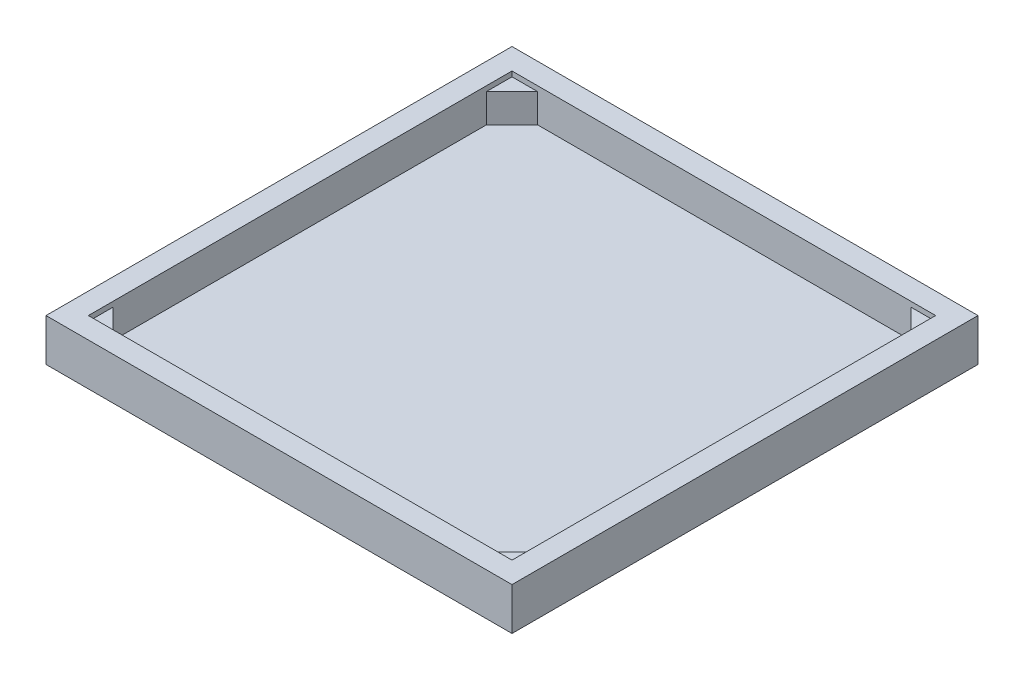
ISO-10303-21;
HEADER;
FILE_DESCRIPTION(('STEP AP214'),'2;1');
FILE_NAME('part.step','',(''),(''),'','','');
FILE_SCHEMA(('AUTOMOTIVE_DESIGN { 1 0 10303 214 1 1 1 1 }'));
ENDSEC;
DATA;
#1=APPLICATION_CONTEXT('core data for automotive mechanical design processes');
#2=APPLICATION_PROTOCOL_DEFINITION('international standard','automotive_design',2000,#1);
#3=PRODUCT_CONTEXT('',#1,'mechanical');
#4=PRODUCT('Part','Part','',(#3));
#5=PRODUCT_RELATED_PRODUCT_CATEGORY('part','',(#4));
#6=PRODUCT_DEFINITION_FORMATION('','',#4);
#7=PRODUCT_DEFINITION_CONTEXT('part definition',#1,'design');
#8=PRODUCT_DEFINITION('design','',#6,#7);
#9=PRODUCT_DEFINITION_SHAPE('','',#8);
#10=(LENGTH_UNIT() NAMED_UNIT(*) SI_UNIT(.MILLI.,.METRE.));
#11=(NAMED_UNIT(*) PLANE_ANGLE_UNIT() SI_UNIT($,.RADIAN.));
#12=(NAMED_UNIT(*) SI_UNIT($,.STERADIAN.) SOLID_ANGLE_UNIT());
#13=UNCERTAINTY_MEASURE_WITH_UNIT(LENGTH_MEASURE(1.E-05),#10,'distance_accuracy_value','');
#14=(GEOMETRIC_REPRESENTATION_CONTEXT(3) GLOBAL_UNCERTAINTY_ASSIGNED_CONTEXT((#13)) GLOBAL_UNIT_ASSIGNED_CONTEXT((#10,
#11,#12)) REPRESENTATION_CONTEXT('',''));
#15=CARTESIAN_POINT('',(0.,0.,0.));
#16=DIRECTION('',(0.,0.,1.));
#17=DIRECTION('',(1.,0.,0.));
#18=AXIS2_PLACEMENT_3D('',#15,#16,#17);
#19=CARTESIAN_POINT('',(0.,10.,0.));
#20=DIRECTION('',(0.,1.,0.));
#21=DIRECTION('',(0.,0.,1.));
#22=AXIS2_PLACEMENT_3D('',#19,#20,#21);
#23=PLANE('',#22);
#24=DIRECTION('',(0.,0.,-1.));
#25=VECTOR('',#24,1.);
#26=CARTESIAN_POINT('',(250.,10.,250.));
#27=LINE('',#26,#25);
#28=CARTESIAN_POINT('',(250.,10.,221.731116008816));
#29=VERTEX_POINT('',#28);
#30=CARTESIAN_POINT('',(250.,10.,-220.865558004408));
#31=VERTEX_POINT('',#30);
#32=EDGE_CURVE('E207',#29,#31,#27,.T.);
#33=ORIENTED_EDGE('',*,*,#32,.T.);
#34=DIRECTION('',(0.707106781186555,0.,0.70710678118654));
#35=VECTOR('',#34,1.);
#36=CARTESIAN_POINT('',(220.865558004405,10.,-250.000000000002));
#37=LINE('',#36,#35);
#38=CARTESIAN_POINT('',(220.865558004405,10.,-250.));
#39=VERTEX_POINT('',#38);
#40=EDGE_CURVE('E162',#39,#31,#37,.T.);
#41=ORIENTED_EDGE('',*,*,#40,.F.);
#42=DIRECTION('',(1.,0.,0.));
#43=VECTOR('',#42,1.);
#44=CARTESIAN_POINT('',(-250.,10.,-250.));
#45=LINE('',#44,#43);
#46=CARTESIAN_POINT('',(-220.,10.,-250.));
#47=VERTEX_POINT('',#46);
#48=EDGE_CURVE('E152',#47,#39,#45,.T.);
#49=ORIENTED_EDGE('',*,*,#48,.F.);
#50=DIRECTION('',(0.707106781186547,0.,-0.707106781186547));
#51=VECTOR('',#50,1.);
#52=CARTESIAN_POINT('',(-250.,10.,-220.));
#53=LINE('',#52,#51);
#54=CARTESIAN_POINT('',(-250.,10.,-220.));
#55=VERTEX_POINT('',#54);
#56=EDGE_CURVE('E188',#55,#47,#53,.T.);
#57=ORIENTED_EDGE('',*,*,#56,.F.);
#58=DIRECTION('',(0.,0.,-1.));
#59=VECTOR('',#58,1.);
#60=CARTESIAN_POINT('',(-250.,10.,250.));
#61=LINE('',#60,#59);
#62=CARTESIAN_POINT('',(-249.999999999999,10.,220.865558004409));
#63=VERTEX_POINT('',#62);
#64=EDGE_CURVE('E211',#63,#55,#61,.T.);
#65=ORIENTED_EDGE('',*,*,#64,.F.);
#66=DIRECTION('',(-0.70710678118655,0.,-0.707106781186545));
#67=VECTOR('',#66,1.);
#68=CARTESIAN_POINT('',(-219.999999999999,10.,250.865558004409));
#69=LINE('',#68,#67);
#70=CARTESIAN_POINT('',(-220.865558004408,10.,250.));
#71=VERTEX_POINT('',#70);
#72=EDGE_CURVE('E178',#71,#63,#69,.T.);
#73=ORIENTED_EDGE('',*,*,#72,.F.);
#74=DIRECTION('',(1.,0.,0.));
#75=VECTOR('',#74,1.);
#76=CARTESIAN_POINT('',(-250.,10.,250.));
#77=LINE('',#76,#75);
#78=CARTESIAN_POINT('',(221.731116008816,10.,250.));
#79=VERTEX_POINT('',#78);
#80=EDGE_CURVE('E204',#71,#79,#77,.T.);
#81=ORIENTED_EDGE('',*,*,#80,.T.);
#82=DIRECTION('',(-0.707106781186547,0.,0.707106781186547));
#83=VECTOR('',#82,1.);
#84=CARTESIAN_POINT('',(250.865558004408,10.,220.865558004408));
#85=LINE('',#84,#83);
#86=EDGE_CURVE('E168',#29,#79,#85,.T.);
#87=ORIENTED_EDGE('',*,*,#86,.F.);
#88=EDGE_LOOP('',(#33,#41,#49,#57,#65,#73,#81,#87));
#89=FACE_BOUND('',#88,.T.);
#90=ADVANCED_FACE('F35',(#89),#23,.T.);
#91=CARTESIAN_POINT('',(250.,10.,250.));
#92=DIRECTION('',(1.,0.,0.));
#93=DIRECTION('',(0.,0.,-1.));
#94=AXIS2_PLACEMENT_3D('',#91,#92,#93);
#95=PLANE('',#94);
#96=DIRECTION('',(0.,1.,0.));
#97=VECTOR('',#96,1.);
#98=CARTESIAN_POINT('',(250.,10.,-220.865558004408));
#99=LINE('',#98,#97);
#100=CARTESIAN_POINT('',(250.,44.,-220.865558004408));
#101=VERTEX_POINT('',#100);
#102=EDGE_CURVE('E54',#31,#101,#99,.T.);
#103=ORIENTED_EDGE('',*,*,#102,.F.);
#104=ORIENTED_EDGE('',*,*,#32,.F.);
#105=DIRECTION('',(0.,-1.,0.));
#106=VECTOR('',#105,1.);
#107=CARTESIAN_POINT('',(250.,10.,221.731116008816));
#108=LINE('',#107,#106);
#109=CARTESIAN_POINT('',(250.,44.,221.731116008816));
#110=VERTEX_POINT('',#109);
#111=EDGE_CURVE('E43',#110,#29,#108,.T.);
#112=ORIENTED_EDGE('',*,*,#111,.F.);
#113=DIRECTION('',(0.,0.,1.));
#114=VECTOR('',#113,1.);
#115=CARTESIAN_POINT('',(250.,44.,250.));
#116=LINE('',#115,#114);
#117=CARTESIAN_POINT('',(250.,44.,250.));
#118=VERTEX_POINT('',#117);
#119=EDGE_CURVE('E266',#110,#118,#116,.T.);
#120=ORIENTED_EDGE('',*,*,#119,.T.);
#121=DIRECTION('',(0.,1.,0.));
#122=VECTOR('',#121,1.);
#123=CARTESIAN_POINT('',(250.,10.,250.));
#124=LINE('',#123,#122);
#125=CARTESIAN_POINT('',(250.,50.,250.));
#126=VERTEX_POINT('',#125);
#127=EDGE_CURVE('E213',#118,#126,#124,.T.);
#128=ORIENTED_EDGE('',*,*,#127,.T.);
#129=DIRECTION('',(0.,0.,-1.));
#130=VECTOR('',#129,1.);
#131=CARTESIAN_POINT('',(250.,50.,250.));
#132=LINE('',#131,#130);
#133=CARTESIAN_POINT('',(250.,50.,-250.));
#134=VERTEX_POINT('',#133);
#135=EDGE_CURVE('E216',#126,#134,#132,.T.);
#136=ORIENTED_EDGE('',*,*,#135,.T.);
#137=DIRECTION('',(0.,1.,0.));
#138=VECTOR('',#137,1.);
#139=CARTESIAN_POINT('',(250.,10.,-250.));
#140=LINE('',#139,#138);
#141=CARTESIAN_POINT('',(250.,44.,-250.));
#142=VERTEX_POINT('',#141);
#143=EDGE_CURVE('E229',#142,#134,#140,.T.);
#144=ORIENTED_EDGE('',*,*,#143,.F.);
#145=DIRECTION('',(0.,0.,1.));
#146=VECTOR('',#145,1.);
#147=CARTESIAN_POINT('',(250.,44.,250.));
#148=LINE('',#147,#146);
#149=EDGE_CURVE('E50',#142,#101,#148,.T.);
#150=ORIENTED_EDGE('',*,*,#149,.T.);
#151=EDGE_LOOP('',(#103,#104,#112,#120,#128,#136,#144,#150));
#152=FACE_BOUND('',#151,.T.);
#153=ADVANCED_FACE('F277',(#152),#95,.F.);
#154=CARTESIAN_POINT('',(-250.,10.,-250.));
#155=DIRECTION('',(0.,0.,1.));
#156=DIRECTION('',(1.,0.,0.));
#157=AXIS2_PLACEMENT_3D('',#154,#155,#156);
#158=PLANE('',#157);
#159=ORIENTED_EDGE('',*,*,#48,.T.);
#160=DIRECTION('',(0.,-1.,0.));
#161=VECTOR('',#160,1.);
#162=CARTESIAN_POINT('',(220.865558004405,44.,-250.000000000002));
#163=LINE('',#162,#161);
#164=CARTESIAN_POINT('',(220.865558004405,44.,-250.000000000002));
#165=VERTEX_POINT('',#164);
#166=EDGE_CURVE('E148',#165,#39,#163,.T.);
#167=ORIENTED_EDGE('',*,*,#166,.F.);
#168=DIRECTION('',(-1.,0.,0.));
#169=VECTOR('',#168,1.);
#170=CARTESIAN_POINT('',(-250.,44.,-250.));
#171=LINE('',#170,#169);
#172=EDGE_CURVE('E11',#142,#165,#171,.T.);
#173=ORIENTED_EDGE('',*,*,#172,.F.);
#174=ORIENTED_EDGE('',*,*,#143,.T.);
#175=DIRECTION('',(1.,0.,0.));
#176=VECTOR('',#175,1.);
#177=CARTESIAN_POINT('',(-250.,50.,-250.));
#178=LINE('',#177,#176);
#179=CARTESIAN_POINT('',(-250.,50.,-250.));
#180=VERTEX_POINT('',#179);
#181=EDGE_CURVE('E219',#180,#134,#178,.T.);
#182=ORIENTED_EDGE('',*,*,#181,.F.);
#183=DIRECTION('',(0.,1.,0.));
#184=VECTOR('',#183,1.);
#185=CARTESIAN_POINT('',(-250.,10.,-250.));
#186=LINE('',#185,#184);
#187=CARTESIAN_POINT('',(-250.,44.,-250.));
#188=VERTEX_POINT('',#187);
#189=EDGE_CURVE('E227',#188,#180,#186,.T.);
#190=ORIENTED_EDGE('',*,*,#189,.F.);
#191=DIRECTION('',(1.,0.,0.));
#192=VECTOR('',#191,1.);
#193=CARTESIAN_POINT('',(-250.,44.,-250.));
#194=LINE('',#193,#192);
#195=CARTESIAN_POINT('',(-220.,44.,-250.));
#196=VERTEX_POINT('',#195);
#197=EDGE_CURVE('E194',#188,#196,#194,.T.);
#198=ORIENTED_EDGE('',*,*,#197,.T.);
#199=DIRECTION('',(0.,-1.,0.));
#200=VECTOR('',#199,1.);
#201=CARTESIAN_POINT('',(-220.,44.,-250.));
#202=LINE('',#201,#200);
#203=EDGE_CURVE('E197',#196,#47,#202,.T.);
#204=ORIENTED_EDGE('',*,*,#203,.T.);
#205=EDGE_LOOP('',(#159,#167,#173,#174,#182,#190,#198,#204));
#206=FACE_BOUND('',#205,.T.);
#207=ADVANCED_FACE('F149',(#206),#158,.T.);
#208=CARTESIAN_POINT('',(-250.,10.,250.));
#209=DIRECTION('',(0.,0.,1.));
#210=DIRECTION('',(1.,0.,0.));
#211=AXIS2_PLACEMENT_3D('',#208,#209,#210);
#212=PLANE('',#211);
#213=DIRECTION('',(0.,1.,0.));
#214=VECTOR('',#213,1.);
#215=CARTESIAN_POINT('',(221.731116008816,10.,250.));
#216=LINE('',#215,#214);
#217=CARTESIAN_POINT('',(221.731116008816,44.,250.));
#218=VERTEX_POINT('',#217);
#219=EDGE_CURVE('E176',#79,#218,#216,.T.);
#220=ORIENTED_EDGE('',*,*,#219,.F.);
#221=ORIENTED_EDGE('',*,*,#80,.F.);
#222=DIRECTION('',(0.,-1.,0.));
#223=VECTOR('',#222,1.);
#224=CARTESIAN_POINT('',(-220.865558004408,10.,250.));
#225=LINE('',#224,#223);
#226=CARTESIAN_POINT('',(-220.865558004408,44.,250.));
#227=VERTEX_POINT('',#226);
#228=EDGE_CURVE('E264',#227,#71,#225,.T.);
#229=ORIENTED_EDGE('',*,*,#228,.F.);
#230=DIRECTION('',(-1.,0.,0.));
#231=VECTOR('',#230,1.);
#232=CARTESIAN_POINT('',(-250.,44.,250.));
#233=LINE('',#232,#231);
#234=CARTESIAN_POINT('',(-250.,44.,250.));
#235=VERTEX_POINT('',#234);
#236=EDGE_CURVE('E261',#227,#235,#233,.T.);
#237=ORIENTED_EDGE('',*,*,#236,.T.);
#238=DIRECTION('',(0.,1.,0.));
#239=VECTOR('',#238,1.);
#240=CARTESIAN_POINT('',(-250.,10.,250.));
#241=LINE('',#240,#239);
#242=CARTESIAN_POINT('',(-250.,50.,250.));
#243=VERTEX_POINT('',#242);
#244=EDGE_CURVE('E224',#235,#243,#241,.T.);
#245=ORIENTED_EDGE('',*,*,#244,.T.);
#246=DIRECTION('',(1.,0.,0.));
#247=VECTOR('',#246,1.);
#248=CARTESIAN_POINT('',(-250.,50.,250.));
#249=LINE('',#248,#247);
#250=EDGE_CURVE('E203',#243,#126,#249,.T.);
#251=ORIENTED_EDGE('',*,*,#250,.T.);
#252=ORIENTED_EDGE('',*,*,#127,.F.);
#253=DIRECTION('',(-1.,0.,0.));
#254=VECTOR('',#253,1.);
#255=CARTESIAN_POINT('',(-250.,44.,250.));
#256=LINE('',#255,#254);
#257=EDGE_CURVE('E172',#118,#218,#256,.T.);
#258=ORIENTED_EDGE('',*,*,#257,.T.);
#259=EDGE_LOOP('',(#220,#221,#229,#237,#245,#251,#252,#258));
#260=FACE_BOUND('',#259,.T.);
#261=ADVANCED_FACE('F284',(#260),#212,.F.);
#262=CARTESIAN_POINT('',(-250.,10.,250.));
#263=DIRECTION('',(1.,0.,0.));
#264=DIRECTION('',(0.,0.,-1.));
#265=AXIS2_PLACEMENT_3D('',#262,#263,#264);
#266=PLANE('',#265);
#267=DIRECTION('',(0.,0.,-1.));
#268=VECTOR('',#267,1.);
#269=CARTESIAN_POINT('',(-249.999999999999,44.,250.865558004409));
#270=LINE('',#269,#268);
#271=CARTESIAN_POINT('',(-249.999999999999,44.,220.865558004409));
#272=VERTEX_POINT('',#271);
#273=EDGE_CURVE('E181',#235,#272,#270,.T.);
#274=ORIENTED_EDGE('',*,*,#273,.T.);
#275=DIRECTION('',(0.,-1.,0.));
#276=VECTOR('',#275,1.);
#277=CARTESIAN_POINT('',(-249.999999999999,44.,220.865558004409));
#278=LINE('',#277,#276);
#279=EDGE_CURVE('E184',#272,#63,#278,.T.);
#280=ORIENTED_EDGE('',*,*,#279,.T.);
#281=ORIENTED_EDGE('',*,*,#64,.T.);
#282=DIRECTION('',(0.,-1.,0.));
#283=VECTOR('',#282,1.);
#284=CARTESIAN_POINT('',(-250.,44.,-220.));
#285=LINE('',#284,#283);
#286=CARTESIAN_POINT('',(-250.,44.,-220.));
#287=VERTEX_POINT('',#286);
#288=EDGE_CURVE('E200',#287,#55,#285,.T.);
#289=ORIENTED_EDGE('',*,*,#288,.F.);
#290=DIRECTION('',(0.,0.,1.));
#291=VECTOR('',#290,1.);
#292=CARTESIAN_POINT('',(-250.,44.,-250.));
#293=LINE('',#292,#291);
#294=EDGE_CURVE('E189',#188,#287,#293,.T.);
#295=ORIENTED_EDGE('',*,*,#294,.F.);
#296=ORIENTED_EDGE('',*,*,#189,.T.);
#297=DIRECTION('',(0.,0.,-1.));
#298=VECTOR('',#297,1.);
#299=CARTESIAN_POINT('',(-250.,50.,250.));
#300=LINE('',#299,#298);
#301=EDGE_CURVE('E208',#243,#180,#300,.T.);
#302=ORIENTED_EDGE('',*,*,#301,.F.);
#303=ORIENTED_EDGE('',*,*,#244,.F.);
#304=EDGE_LOOP('',(#274,#280,#281,#289,#295,#296,#302,#303));
#305=FACE_BOUND('',#304,.T.);
#306=ADVANCED_FACE('F291',(#305),#266,.T.);
#307=CARTESIAN_POINT('',(275.,50.,275.));
#308=DIRECTION('',(-1.,0.,0.));
#309=DIRECTION('',(0.,0.,1.));
#310=AXIS2_PLACEMENT_3D('',#307,#308,#309);
#311=PLANE('',#310);
#312=DIRECTION('',(0.,0.,-1.));
#313=VECTOR('',#312,1.);
#314=CARTESIAN_POINT('',(275.,0.,275.));
#315=LINE('',#314,#313);
#316=CARTESIAN_POINT('',(275.,0.,275.));
#317=VERTEX_POINT('',#316);
#318=CARTESIAN_POINT('',(275.,0.,-275.));
#319=VERTEX_POINT('',#318);
#320=EDGE_CURVE('E226',#317,#319,#315,.T.);
#321=ORIENTED_EDGE('',*,*,#320,.T.);
#322=DIRECTION('',(0.,-1.,0.));
#323=VECTOR('',#322,1.);
#324=CARTESIAN_POINT('',(275.,50.,-275.));
#325=LINE('',#324,#323);
#326=CARTESIAN_POINT('',(275.,50.,-275.));
#327=VERTEX_POINT('',#326);
#328=EDGE_CURVE('E258',#327,#319,#325,.T.);
#329=ORIENTED_EDGE('',*,*,#328,.F.);
#330=DIRECTION('',(0.,0.,-1.));
#331=VECTOR('',#330,1.);
#332=CARTESIAN_POINT('',(275.,50.,275.));
#333=LINE('',#332,#331);
#334=CARTESIAN_POINT('',(275.,50.,275.));
#335=VERTEX_POINT('',#334);
#336=EDGE_CURVE('E232',#335,#327,#333,.T.);
#337=ORIENTED_EDGE('',*,*,#336,.F.);
#338=DIRECTION('',(0.,-1.,0.));
#339=VECTOR('',#338,1.);
#340=CARTESIAN_POINT('',(275.,50.,275.));
#341=LINE('',#340,#339);
#342=EDGE_CURVE('E242',#335,#317,#341,.T.);
#343=ORIENTED_EDGE('',*,*,#342,.T.);
#344=EDGE_LOOP('',(#321,#329,#337,#343));
#345=FACE_BOUND('',#344,.T.);
#346=ADVANCED_FACE('F37',(#345),#311,.F.);
#347=CARTESIAN_POINT('',(-275.,50.,-275.));
#348=DIRECTION('',(0.,0.,1.));
#349=DIRECTION('',(1.,0.,0.));
#350=AXIS2_PLACEMENT_3D('',#347,#348,#349);
#351=PLANE('',#350);
#352=DIRECTION('',(-1.,0.,0.));
#353=VECTOR('',#352,1.);
#354=CARTESIAN_POINT('',(-275.,0.,-275.));
#355=LINE('',#354,#353);
#356=CARTESIAN_POINT('',(-275.,0.,-275.));
#357=VERTEX_POINT('',#356);
#358=EDGE_CURVE('E245',#319,#357,#355,.T.);
#359=ORIENTED_EDGE('',*,*,#358,.T.);
#360=DIRECTION('',(0.,-1.,0.));
#361=VECTOR('',#360,1.);
#362=CARTESIAN_POINT('',(-275.,50.,-275.));
#363=LINE('',#362,#361);
#364=CARTESIAN_POINT('',(-275.,50.,-275.));
#365=VERTEX_POINT('',#364);
#366=EDGE_CURVE('E255',#365,#357,#363,.T.);
#367=ORIENTED_EDGE('',*,*,#366,.F.);
#368=DIRECTION('',(-1.,0.,0.));
#369=VECTOR('',#368,1.);
#370=CARTESIAN_POINT('',(-275.,50.,-275.));
#371=LINE('',#370,#369);
#372=EDGE_CURVE('E235',#327,#365,#371,.T.);
#373=ORIENTED_EDGE('',*,*,#372,.F.);
#374=ORIENTED_EDGE('',*,*,#328,.T.);
#375=EDGE_LOOP('',(#359,#367,#373,#374));
#376=FACE_BOUND('',#375,.T.);
#377=ADVANCED_FACE('F308',(#376),#351,.F.);
#378=CARTESIAN_POINT('',(-275.,50.,275.));
#379=DIRECTION('',(1.,0.,0.));
#380=DIRECTION('',(0.,0.,-1.));
#381=AXIS2_PLACEMENT_3D('',#378,#379,#380);
#382=PLANE('',#381);
#383=DIRECTION('',(0.,0.,1.));
#384=VECTOR('',#383,1.);
#385=CARTESIAN_POINT('',(-275.,0.,275.));
#386=LINE('',#385,#384);
#387=CARTESIAN_POINT('',(-275.,0.,275.));
#388=VERTEX_POINT('',#387);
#389=EDGE_CURVE('E247',#357,#388,#386,.T.);
#390=ORIENTED_EDGE('',*,*,#389,.T.);
#391=DIRECTION('',(0.,-1.,0.));
#392=VECTOR('',#391,1.);
#393=CARTESIAN_POINT('',(-275.,50.,275.));
#394=LINE('',#393,#392);
#395=CARTESIAN_POINT('',(-275.,50.,275.));
#396=VERTEX_POINT('',#395);
#397=EDGE_CURVE('E252',#396,#388,#394,.T.);
#398=ORIENTED_EDGE('',*,*,#397,.F.);
#399=DIRECTION('',(0.,0.,1.));
#400=VECTOR('',#399,1.);
#401=CARTESIAN_POINT('',(-275.,50.,275.));
#402=LINE('',#401,#400);
#403=EDGE_CURVE('E238',#365,#396,#402,.T.);
#404=ORIENTED_EDGE('',*,*,#403,.F.);
#405=ORIENTED_EDGE('',*,*,#366,.T.);
#406=EDGE_LOOP('',(#390,#398,#404,#405));
#407=FACE_BOUND('',#406,.T.);
#408=ADVANCED_FACE('F305',(#407),#382,.F.);
#409=CARTESIAN_POINT('',(-275.,50.,275.));
#410=DIRECTION('',(0.,0.,-1.));
#411=DIRECTION('',(-1.,0.,0.));
#412=AXIS2_PLACEMENT_3D('',#409,#410,#411);
#413=PLANE('',#412);
#414=DIRECTION('',(1.,0.,0.));
#415=VECTOR('',#414,1.);
#416=CARTESIAN_POINT('',(-275.,0.,275.));
#417=LINE('',#416,#415);
#418=EDGE_CURVE('E236',#388,#317,#417,.T.);
#419=ORIENTED_EDGE('',*,*,#418,.T.);
#420=ORIENTED_EDGE('',*,*,#342,.F.);
#421=DIRECTION('',(1.,0.,0.));
#422=VECTOR('',#421,1.);
#423=CARTESIAN_POINT('',(-275.,50.,275.));
#424=LINE('',#423,#422);
#425=EDGE_CURVE('E240',#396,#335,#424,.T.);
#426=ORIENTED_EDGE('',*,*,#425,.F.);
#427=ORIENTED_EDGE('',*,*,#397,.T.);
#428=EDGE_LOOP('',(#419,#420,#426,#427));
#429=FACE_BOUND('',#428,.T.);
#430=ADVANCED_FACE('F297',(#429),#413,.F.);
#431=CARTESIAN_POINT('',(0.,50.,0.));
#432=DIRECTION('',(0.,-1.,0.));
#433=DIRECTION('',(0.,0.,-1.));
#434=AXIS2_PLACEMENT_3D('',#431,#432,#433);
#435=PLANE('',#434);
#436=ORIENTED_EDGE('',*,*,#135,.F.);
#437=ORIENTED_EDGE('',*,*,#250,.F.);
#438=ORIENTED_EDGE('',*,*,#301,.T.);
#439=ORIENTED_EDGE('',*,*,#181,.T.);
#440=EDGE_LOOP('',(#436,#437,#438,#439));
#441=FACE_BOUND('',#440,.T.);
#442=ORIENTED_EDGE('',*,*,#336,.T.);
#443=ORIENTED_EDGE('',*,*,#372,.T.);
#444=ORIENTED_EDGE('',*,*,#403,.T.);
#445=ORIENTED_EDGE('',*,*,#425,.T.);
#446=EDGE_LOOP('',(#442,#443,#444,#445));
#447=FACE_BOUND('',#446,.T.);
#448=ADVANCED_FACE('F293',(#441,#447),#435,.F.);
#449=CARTESIAN_POINT('',(0.,0.,0.));
#450=DIRECTION('',(0.,-1.,0.));
#451=DIRECTION('',(0.,0.,-1.));
#452=AXIS2_PLACEMENT_3D('',#449,#450,#451);
#453=PLANE('',#452);
#454=ORIENTED_EDGE('',*,*,#320,.F.);
#455=ORIENTED_EDGE('',*,*,#418,.F.);
#456=ORIENTED_EDGE('',*,*,#389,.F.);
#457=ORIENTED_EDGE('',*,*,#358,.F.);
#458=EDGE_LOOP('',(#454,#455,#456,#457));
#459=FACE_BOUND('',#458,.T.);
#460=ADVANCED_FACE('F296',(#459),#453,.T.);
#461=CARTESIAN_POINT('',(-250.,44.,-220.));
#462=DIRECTION('',(-0.707106781186548,0.,-0.707106781186548));
#463=DIRECTION('',(-0.707106781186548,0.,0.707106781186548));
#464=AXIS2_PLACEMENT_3D('',#461,#462,#463);
#465=PLANE('',#464);
#466=ORIENTED_EDGE('',*,*,#56,.T.);
#467=ORIENTED_EDGE('',*,*,#203,.F.);
#468=DIRECTION('',(0.707106781186547,0.,-0.707106781186547));
#469=VECTOR('',#468,1.);
#470=CARTESIAN_POINT('',(-250.,44.,-220.));
#471=LINE('',#470,#469);
#472=EDGE_CURVE('E192',#287,#196,#471,.T.);
#473=ORIENTED_EDGE('',*,*,#472,.F.);
#474=ORIENTED_EDGE('',*,*,#288,.T.);
#475=EDGE_LOOP('',(#466,#467,#473,#474));
#476=FACE_BOUND('',#475,.T.);
#477=ADVANCED_FACE('F301',(#476),#465,.F.);
#478=CARTESIAN_POINT('',(0.,44.,0.));
#479=DIRECTION('',(0.,1.,0.));
#480=DIRECTION('',(0.,0.,1.));
#481=AXIS2_PLACEMENT_3D('',#478,#479,#480);
#482=PLANE('',#481);
#483=ORIENTED_EDGE('',*,*,#294,.T.);
#484=ORIENTED_EDGE('',*,*,#472,.T.);
#485=ORIENTED_EDGE('',*,*,#197,.F.);
#486=EDGE_LOOP('',(#483,#484,#485));
#487=FACE_BOUND('',#486,.T.);
#488=ADVANCED_FACE('F336',(#487),#482,.T.);
#489=CARTESIAN_POINT('',(-219.999999999999,44.,250.865558004409));
#490=DIRECTION('',(-0.707106781186545,0.,0.70710678118655));
#491=DIRECTION('',(0.70710678118655,0.,0.707106781186545));
#492=AXIS2_PLACEMENT_3D('',#489,#490,#491);
#493=PLANE('',#492);
#494=DIRECTION('',(-0.70710678118655,0.,-0.707106781186545));
#495=VECTOR('',#494,1.);
#496=CARTESIAN_POINT('',(-219.999999999999,44.,250.865558004409));
#497=LINE('',#496,#495);
#498=EDGE_CURVE('E179',#227,#272,#497,.T.);
#499=ORIENTED_EDGE('',*,*,#498,.F.);
#500=ORIENTED_EDGE('',*,*,#228,.T.);
#501=ORIENTED_EDGE('',*,*,#72,.T.);
#502=ORIENTED_EDGE('',*,*,#279,.F.);
#503=EDGE_LOOP('',(#499,#500,#501,#502));
#504=FACE_BOUND('',#503,.T.);
#505=ADVANCED_FACE('F340',(#504),#493,.F.);
#506=CARTESIAN_POINT('',(0.,44.,0.865558004407914));
#507=DIRECTION('',(0.,1.,0.));
#508=DIRECTION('',(1.,0.,0.));
#509=AXIS2_PLACEMENT_3D('',#506,#507,#508);
#510=PLANE('',#509);
#511=ORIENTED_EDGE('',*,*,#236,.F.);
#512=ORIENTED_EDGE('',*,*,#498,.T.);
#513=ORIENTED_EDGE('',*,*,#273,.F.);
#514=EDGE_LOOP('',(#511,#512,#513));
#515=FACE_BOUND('',#514,.T.);
#516=ADVANCED_FACE('F344',(#515),#510,.T.);
#517=CARTESIAN_POINT('',(250.865558004408,44.,220.865558004408));
#518=DIRECTION('',(0.707106781186548,0.,0.707106781186548));
#519=DIRECTION('',(0.707106781186548,0.,-0.707106781186548));
#520=AXIS2_PLACEMENT_3D('',#517,#518,#519);
#521=PLANE('',#520);
#522=ORIENTED_EDGE('',*,*,#86,.T.);
#523=ORIENTED_EDGE('',*,*,#219,.T.);
#524=DIRECTION('',(-0.707106781186547,0.,0.707106781186547));
#525=VECTOR('',#524,1.);
#526=CARTESIAN_POINT('',(250.865558004408,44.,220.865558004408));
#527=LINE('',#526,#525);
#528=EDGE_CURVE('E169',#110,#218,#527,.T.);
#529=ORIENTED_EDGE('',*,*,#528,.F.);
#530=ORIENTED_EDGE('',*,*,#111,.T.);
#531=EDGE_LOOP('',(#522,#523,#529,#530));
#532=FACE_BOUND('',#531,.T.);
#533=ADVANCED_FACE('F272',(#532),#521,.F.);
#534=CARTESIAN_POINT('',(0.865558004407893,44.,0.865558004407931));
#535=DIRECTION('',(0.,1.,0.));
#536=DIRECTION('',(0.,0.,-1.));
#537=AXIS2_PLACEMENT_3D('',#534,#535,#536);
#538=PLANE('',#537);
#539=ORIENTED_EDGE('',*,*,#257,.F.);
#540=ORIENTED_EDGE('',*,*,#119,.F.);
#541=ORIENTED_EDGE('',*,*,#528,.T.);
#542=EDGE_LOOP('',(#539,#540,#541));
#543=FACE_BOUND('',#542,.T.);
#544=ADVANCED_FACE('F351',(#543),#538,.T.);
#545=CARTESIAN_POINT('',(220.865558004405,44.,-250.000000000002));
#546=DIRECTION('',(0.70710678118654,0.,-0.707106781186555));
#547=DIRECTION('',(-0.707106781186555,0.,-0.70710678118654));
#548=AXIS2_PLACEMENT_3D('',#545,#546,#547);
#549=PLANE('',#548);
#550=ORIENTED_EDGE('',*,*,#40,.T.);
#551=ORIENTED_EDGE('',*,*,#102,.T.);
#552=DIRECTION('',(0.707106781186555,0.,0.70710678118654));
#553=VECTOR('',#552,1.);
#554=CARTESIAN_POINT('',(220.865558004405,44.,-250.000000000002));
#555=LINE('',#554,#553);
#556=EDGE_CURVE('E156',#165,#101,#555,.T.);
#557=ORIENTED_EDGE('',*,*,#556,.F.);
#558=ORIENTED_EDGE('',*,*,#166,.T.);
#559=EDGE_LOOP('',(#550,#551,#557,#558));
#560=FACE_BOUND('',#559,.T.);
#561=ADVANCED_FACE('F161',(#560),#549,.F.);
#562=CARTESIAN_POINT('',(0.865558004407908,44.,0.));
#563=DIRECTION('',(0.,1.,0.));
#564=DIRECTION('',(-1.,0.,0.));
#565=AXIS2_PLACEMENT_3D('',#562,#563,#564);
#566=PLANE('',#565);
#567=ORIENTED_EDGE('',*,*,#149,.F.);
#568=ORIENTED_EDGE('',*,*,#172,.T.);
#569=ORIENTED_EDGE('',*,*,#556,.T.);
#570=EDGE_LOOP('',(#567,#568,#569));
#571=FACE_BOUND('',#570,.T.);
#572=ADVANCED_FACE('F160',(#571),#566,.T.);
#573=CLOSED_SHELL('',(#90,#153,#207,#261,#306,#346,#377,#408,#430,#448,#460,#477,#488,#505,#516,
#533,#544,#561,#572));
#574=MANIFOLD_SOLID_BREP('B2',#573);
#575=ADVANCED_BREP_SHAPE_REPRESENTATION('',(#18,#574),#14);
#576=SHAPE_DEFINITION_REPRESENTATION(#9,#575);
ENDSEC;
END-ISO-10303-21;
